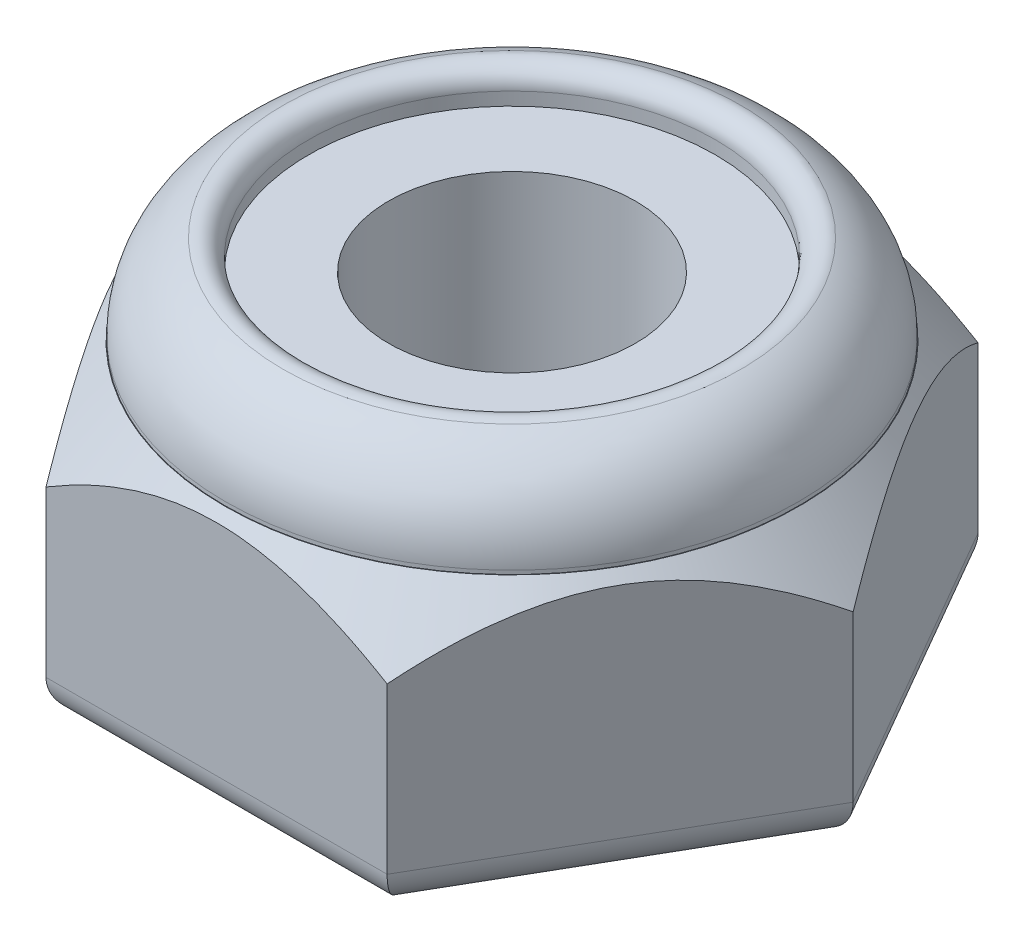
ISO-10303-21;
HEADER;
FILE_DESCRIPTION(('STEP AP214'),'2;1');
FILE_NAME('part.step','',(''),(''),'','','');
FILE_SCHEMA(('AUTOMOTIVE_DESIGN { 1 0 10303 214 1 1 1 1 }'));
ENDSEC;
DATA;
#1=APPLICATION_CONTEXT('core data for automotive mechanical design processes');
#2=APPLICATION_PROTOCOL_DEFINITION('international standard','automotive_design',2000,#1);
#3=PRODUCT_CONTEXT('',#1,'mechanical');
#4=PRODUCT('Part','Part','',(#3));
#5=PRODUCT_RELATED_PRODUCT_CATEGORY('part','',(#4));
#6=PRODUCT_DEFINITION_FORMATION('','',#4);
#7=PRODUCT_DEFINITION_CONTEXT('part definition',#1,'design');
#8=PRODUCT_DEFINITION('design','',#6,#7);
#9=PRODUCT_DEFINITION_SHAPE('','',#8);
#10=(LENGTH_UNIT() NAMED_UNIT(*) SI_UNIT(.MILLI.,.METRE.));
#11=(NAMED_UNIT(*) PLANE_ANGLE_UNIT() SI_UNIT($,.RADIAN.));
#12=(NAMED_UNIT(*) SI_UNIT($,.STERADIAN.) SOLID_ANGLE_UNIT());
#13=UNCERTAINTY_MEASURE_WITH_UNIT(LENGTH_MEASURE(1.E-05),#10,'distance_accuracy_value','');
#14=(GEOMETRIC_REPRESENTATION_CONTEXT(3) GLOBAL_UNCERTAINTY_ASSIGNED_CONTEXT((#13)) GLOBAL_UNIT_ASSIGNED_CONTEXT((#10,
#11,#12)) REPRESENTATION_CONTEXT('',''));
#15=CARTESIAN_POINT('',(0.,0.,0.));
#16=DIRECTION('',(0.,0.,1.));
#17=DIRECTION('',(1.,0.,0.));
#18=AXIS2_PLACEMENT_3D('',#15,#16,#17);
#19=CARTESIAN_POINT('',(0.,4.9784,0.));
#20=DIRECTION('',(0.,-1.,0.));
#21=DIRECTION('',(0.,0.,1.));
#22=AXIS2_PLACEMENT_3D('',#19,#20,#21);
#23=CYLINDRICAL_SURFACE('',#22,3.937);
#24=CARTESIAN_POINT('',(0.,3.7084,0.));
#25=DIRECTION('',(0.,-1.,0.));
#26=DIRECTION('',(0.,0.,-1.));
#27=AXIS2_PLACEMENT_3D('',#24,#25,#26);
#28=CIRCLE('',#27,3.937);
#29=CARTESIAN_POINT('',(0.,3.7084,-3.937));
#30=VERTEX_POINT('',#29);
#31=EDGE_CURVE('E170',#30,#30,#28,.T.);
#32=ORIENTED_EDGE('',*,*,#31,.T.);
#33=EDGE_LOOP('',(#32));
#34=FACE_BOUND('',#33,.T.);
#35=CARTESIAN_POINT('',(0.,3.6576,0.));
#36=DIRECTION('',(0.,1.,0.));
#37=DIRECTION('',(0.,0.,1.));
#38=AXIS2_PLACEMENT_3D('',#35,#36,#37);
#39=CIRCLE('',#38,3.937);
#40=CARTESIAN_POINT('',(0.,3.6576,3.937));
#41=VERTEX_POINT('',#40);
#42=EDGE_CURVE('E37',#41,#41,#39,.F.);
#43=ORIENTED_EDGE('',*,*,#42,.F.);
#44=EDGE_LOOP('',(#43));
#45=FACE_BOUND('',#44,.T.);
#46=ADVANCED_FACE('F34',(#34,#45),#23,.T.);
#47=CARTESIAN_POINT('',(0.,3.7084,0.));
#48=DIRECTION('',(0.,1.,0.));
#49=DIRECTION('',(0.,0.,-1.));
#50=AXIS2_PLACEMENT_3D('',#47,#48,#49);
#51=TOROIDAL_SURFACE('',#50,2.667,1.27);
#52=ORIENTED_EDGE('',*,*,#31,.F.);
#53=EDGE_LOOP('',(#52));
#54=FACE_BOUND('',#53,.T.);
#55=CARTESIAN_POINT('',(0.,4.88572150982644,0.));
#56=DIRECTION('',(0.,1.,0.));
#57=DIRECTION('',(0.,0.,1.));
#58=AXIS2_PLACEMENT_3D('',#55,#56,#57);
#59=CIRCLE('',#58,3.14325);
#60=CARTESIAN_POINT('',(0.,4.88572150982644,3.14325));
#61=VERTEX_POINT('',#60);
#62=EDGE_CURVE('E174',#61,#61,#59,.F.);
#63=ORIENTED_EDGE('',*,*,#62,.T.);
#64=EDGE_LOOP('',(#63));
#65=FACE_BOUND('',#64,.T.);
#66=ADVANCED_FACE('F160',(#54,#65),#51,.T.);
#67=CARTESIAN_POINT('',(2.34315,3.6576,-4.05845484975502));
#68=DIRECTION('',(0.,-1.,0.));
#69=DIRECTION('',(0.,0.,1.));
#70=AXIS2_PLACEMENT_3D('',#67,#68,#69);
#71=PLANE('',#70);
#72=ORIENTED_EDGE('',*,*,#42,.T.);
#73=EDGE_LOOP('',(#72));
#74=FACE_BOUND('',#73,.T.);
#75=CARTESIAN_POINT('',(0.,3.65760000011051,0.));
#76=DIRECTION('',(0.,1.,0.));
#77=DIRECTION('',(0.,0.,1.));
#78=AXIS2_PLACEMENT_3D('',#75,#76,#77);
#79=CIRCLE('',#78,3.94407100938664);
#80=CARTESIAN_POINT('',(0.,3.65760000011051,3.94407100938664));
#81=VERTEX_POINT('',#80);
#82=EDGE_CURVE('E130',#81,#81,#79,.T.);
#83=ORIENTED_EDGE('',*,*,#82,.T.);
#84=EDGE_LOOP('',(#83));
#85=FACE_BOUND('',#84,.T.);
#86=ADVANCED_FACE('F165',(#74,#85),#71,.F.);
#87=CARTESIAN_POINT('',(0.,4.65025720786115,0.));
#88=DIRECTION('',(0.,-1.,0.));
#89=DIRECTION('',(0.,0.,1.));
#90=AXIS2_PLACEMENT_3D('',#87,#88,#89);
#91=TOROIDAL_SURFACE('',#90,3.048,0.254);
#92=CARTESIAN_POINT('',(0.,4.65025720786115,0.));
#93=DIRECTION('',(0.,-1.,0.));
#94=DIRECTION('',(0.,0.,-1.));
#95=AXIS2_PLACEMENT_3D('',#92,#93,#94);
#96=CIRCLE('',#95,2.794);
#97=CARTESIAN_POINT('',(0.,4.65025720786115,-2.794));
#98=VERTEX_POINT('',#97);
#99=EDGE_CURVE('E127',#98,#98,#96,.F.);
#100=ORIENTED_EDGE('',*,*,#99,.F.);
#101=EDGE_LOOP('',(#100));
#102=FACE_BOUND('',#101,.T.);
#103=ORIENTED_EDGE('',*,*,#62,.F.);
#104=EDGE_LOOP('',(#103));
#105=FACE_BOUND('',#104,.T.);
#106=ADVANCED_FACE('F157',(#102,#105),#91,.T.);
#107=CARTESIAN_POINT('',(0.,2.76773860969115,0.));
#108=DIRECTION('',(0.,-1.,0.));
#109=DIRECTION('',(0.,0.,1.));
#110=AXIS2_PLACEMENT_3D('',#107,#108,#109);
#111=CONICAL_SURFACE('',#110,4.69075337389313,0.698131700802158);
#112=CARTESIAN_POINT('',(-4.68630000001476,2.77304593398821,5.3333815551093E-11));
#113=CARTESIAN_POINT('',(-4.65177717141793,2.81418235889091,-0.0597952931149053));
#114=CARTESIAN_POINT('',(-4.61695780288956,2.85432113110728,-0.120104208500933));
#115=CARTESIAN_POINT('',(-4.54666264441453,2.93230661020916,-0.241858994511412));
#116=CARTESIAN_POINT('',(-4.51118655194523,2.97015222462005,-0.303305389120424));
#117=CARTESIAN_POINT('',(-4.40329561885259,3.08018701500149,-0.490177966909938));
#118=CARTESIAN_POINT('',(-4.32983334004397,3.14837015576205,-0.617418366247689));
#119=CARTESIAN_POINT('',(-4.1797796499728,3.27092778609509,-0.877318981315214));
#120=CARTESIAN_POINT('',(-4.10317943932402,3.32525984886677,-1.00999443802899));
#121=CARTESIAN_POINT('',(-3.94747591651278,3.41577217646147,-1.27968085045525));
#122=CARTESIAN_POINT('',(-3.86837998243724,3.45200143013375,-1.4166790269463));
#123=CARTESIAN_POINT('',(-3.73746585196202,3.49372811243502,-1.64342895235813));
#124=CARTESIAN_POINT('',(-3.68614686019516,3.50560413715319,-1.73231605349153));
#125=CARTESIAN_POINT('',(-3.58316406708587,3.52008140702852,-1.91068748346216));
#126=CARTESIAN_POINT('',(-3.53150020834088,3.5226810675312,-2.00017191172355));
#127=CARTESIAN_POINT('',(-3.42855034551142,3.51847006524789,-2.17848630477643));
#128=CARTESIAN_POINT('',(-3.3772638088531,3.51171021118305,-2.26731719201287));
#129=CARTESIAN_POINT('',(-3.27519197708947,3.48921023555424,-2.4441107906491));
#130=CARTESIAN_POINT('',(-3.22440670715057,3.4734696654174,-2.53207345845939));
#131=CARTESIAN_POINT('',(-3.10963060134479,3.42817062222156,-2.73087150520989));
#132=CARTESIAN_POINT('',(-3.04589899577138,3.39598542076133,-2.84125788411098));
#133=CARTESIAN_POINT('',(-2.92018166739655,3.32004827846255,-3.05900668424801));
#134=CARTESIAN_POINT('',(-2.85819691962206,3.27629001415058,-3.16636741668776));
#135=CARTESIAN_POINT('',(-2.735889068299,3.17910361386979,-3.37821082934389));
#136=CARTESIAN_POINT('',(-2.67557364738244,3.12563730731956,-3.48268020285126));
#137=CARTESIAN_POINT('',(-2.55683004320588,3.01104764609313,-3.68835015835892));
#138=CARTESIAN_POINT('',(-2.49840123089761,2.94992687749399,-3.78955182990274));
#139=CARTESIAN_POINT('',(-2.42439626092569,2.86741854625153,-3.91773219790672));
#140=CARTESIAN_POINT('',(-2.40802320106583,2.84883596648691,-3.94609116945937));
#141=CARTESIAN_POINT('',(-2.3754621576302,2.81125673907332,-4.00248855103733));
#142=CARTESIAN_POINT('',(-2.35927376441604,2.79226151161516,-4.03052767057717));
#143=CARTESIAN_POINT('',(-2.3431499999717,2.77304593399368,-4.05845484980404));
#144=B_SPLINE_CURVE_WITH_KNOTS('',3,(#112,#113,#114,#115,#116,#117,#118,#119,#120,#121,#122,
#123,#124,#125,#126,#127,#128,#129,#130,#131,#132,#133,#134,#135,#136,#137,#138,#139,#140,#141,
#142,#143),.UNSPECIFIED.,.F.,.F.,(4,2,2,2,2,2,2,2,2,2,2,2,2,2,2,4),(0.,0.241096809088565,
0.48230758945251,0.967637153847365,1.45443592242802,1.93991010956963,2.24950193433618,
2.5591466432483,2.86711700071403,3.17510274216898,3.56882084711336,3.96275452403261,
4.35827201930639,4.75365624679115,4.86660838982693,4.97921936905084),.UNSPECIFIED.);
#145=CARTESIAN_POINT('',(-4.68630000002839,2.77304593399358,0.));
#146=VERTEX_POINT('',#145);
#147=CARTESIAN_POINT('',(-2.34315000001419,2.77304593399358,-4.05845484977959));
#148=VERTEX_POINT('',#147);
#149=EDGE_CURVE('E111',#146,#148,#144,.T.);
#150=ORIENTED_EDGE('',*,*,#149,.F.);
#151=CARTESIAN_POINT('',(-2.3431499999612,2.77304593398821,4.05845484979447));
#152=CARTESIAN_POINT('',(-2.37767282857321,2.81418235889091,3.99865955663499));
#153=CARTESIAN_POINT('',(-2.41249219710802,2.85432113110728,3.93835064125268));
#154=CARTESIAN_POINT('',(-2.48278735558791,2.93230661020916,3.81659585524501));
#155=CARTESIAN_POINT('',(-2.51826344805563,2.97015222462005,3.75514946063508));
#156=CARTESIAN_POINT('',(-2.62615438114571,3.08018701500149,3.56827688284409));
#157=CARTESIAN_POINT('',(-2.69961665995557,3.14837015576205,3.44103648350706));
#158=CARTESIAN_POINT('',(-2.84967035002766,3.27092778609509,3.18113586844007));
#159=CARTESIAN_POINT('',(-2.9262705606761,3.32525984886676,3.0484604117261));
#160=CARTESIAN_POINT('',(-3.08197408348711,3.41577217646147,2.7787739992997));
#161=CARTESIAN_POINT('',(-3.16107001756274,3.45200143013375,2.6417758228087));
#162=CARTESIAN_POINT('',(-3.291984148038,3.49372811243502,2.4150258973969));
#163=CARTESIAN_POINT('',(-3.34330313980485,3.50560413715318,2.32613879626349));
#164=CARTESIAN_POINT('',(-3.44628593291413,3.52008140702852,2.14776736629286));
#165=CARTESIAN_POINT('',(-3.49794979165912,3.5226810675312,2.05828293803147));
#166=CARTESIAN_POINT('',(-3.60089965448859,3.51847006524788,1.87996854497859));
#167=CARTESIAN_POINT('',(-3.6521861911469,3.51171021118305,1.79113765774214));
#168=CARTESIAN_POINT('',(-3.75425802291053,3.48921023555424,1.61434405910592));
#169=CARTESIAN_POINT('',(-3.80504329284944,3.4734696654174,1.52638139129563));
#170=CARTESIAN_POINT('',(-3.91981939865521,3.42817062222155,1.32758334454512));
#171=CARTESIAN_POINT('',(-3.98355100422863,3.39598542076132,1.21719696564403));
#172=CARTESIAN_POINT('',(-4.10926833260346,3.32004827846254,0.999448165507007));
#173=CARTESIAN_POINT('',(-4.17125308037794,3.27629001415057,0.892087433067258));
#174=CARTESIAN_POINT('',(-4.29356093170101,3.17910361386978,0.680244020411132));
#175=CARTESIAN_POINT('',(-4.35387635261756,3.12563730731955,0.575774646903757));
#176=CARTESIAN_POINT('',(-4.47261995679413,3.01104764609312,0.370104691396094));
#177=CARTESIAN_POINT('',(-4.53104876910239,2.94992687749399,0.268903019852276));
#178=CARTESIAN_POINT('',(-4.60505373907432,2.86741854625152,0.140722651848295));
#179=CARTESIAN_POINT('',(-4.62142679893418,2.84883596648691,0.112363680295645));
#180=CARTESIAN_POINT('',(-4.6539878423698,2.81125673907331,0.0559662987176857));
#181=CARTESIAN_POINT('',(-4.67017623558397,2.79226151161515,0.0279271791778497));
#182=CARTESIAN_POINT('',(-4.68630000002831,2.77304593399367,-4.90190782069009E-11));
#183=B_SPLINE_CURVE_WITH_KNOTS('',3,(#151,#152,#153,#154,#155,#156,#157,#158,#159,#160,#161,
#162,#163,#164,#165,#166,#167,#168,#169,#170,#171,#172,#173,#174,#175,#176,#177,#178,#179,#180,
#181,#182),.UNSPECIFIED.,.F.,.F.,(4,2,2,2,2,2,2,2,2,2,2,2,2,2,2,4),(0.,0.241096809088564,
0.482307589452509,0.967637153847362,1.45443592242802,1.93991010956962,2.24950193433617,
2.5591466432483,2.86711700071402,3.17510274216897,3.56882084711335,3.9627545240326,
4.35827201930639,4.75365624679114,4.86660838982692,4.97921936905084),.UNSPECIFIED.);
#184=CARTESIAN_POINT('',(-2.34315000001419,2.77304593399358,4.0584548497796));
#185=VERTEX_POINT('',#184);
#186=EDGE_CURVE('E239',#185,#146,#183,.T.);
#187=ORIENTED_EDGE('',*,*,#186,.F.);
#188=CARTESIAN_POINT('',(2.34315000005357,2.77304593398821,4.05845484974114));
#189=CARTESIAN_POINT('',(2.27415972170409,2.81414935271335,4.05845484974989));
#190=CARTESIAN_POINT('',(2.20457738522045,2.85425669884704,4.05845484975361));
#191=CARTESIAN_POINT('',(2.06410193528096,2.93218331968193,4.05845484975643));
#192=CARTESIAN_POINT('',(1.99320821641151,2.97000150131419,4.05845484975552));
#193=CARTESIAN_POINT('',(1.77754688772429,3.07999086386454,4.05845484975402));
#194=CARTESIAN_POINT('',(1.63068545869954,3.1481589403704,4.0584548497547));
#195=CARTESIAN_POINT('',(1.33052752457963,3.27077676919261,4.05845484975534));
#196=CARTESIAN_POINT('',(1.17720631609342,3.32516696804195,4.0584548497553));
#197=CARTESIAN_POINT('',(0.865613503807778,3.41574608766058,4.05845484975474));
#198=CARTESIAN_POINT('',(0.707359229311901,3.45199244874898,4.0584548497542));
#199=CARTESIAN_POINT('',(0.456822143345069,3.49192146546895,4.05845484975548));
#200=CARTESIAN_POINT('',(0.365672921156201,3.50290887295604,4.05845484975637));
#201=CARTESIAN_POINT('',(0.183016322004481,3.51758027913677,4.05845484975367));
#202=CARTESIAN_POINT('',(0.0915105175250814,3.5212834103706,4.05845484975008));
#203=CARTESIAN_POINT('',(-0.104649468641441,3.52128177491764,4.0584548497495));
#204=CARTESIAN_POINT('',(-0.209305100872023,3.51643705333648,4.05845484975354));
#205=CARTESIAN_POINT('',(-0.41778718190987,3.49730239560234,4.0584548497565));
#206=CARTESIAN_POINT('',(-0.521613181352877,3.48300765111693,4.05845484975542));
#207=CARTESIAN_POINT('',(-0.728332544913562,3.44553375886281,4.05845484975462));
#208=CARTESIAN_POINT('',(-0.831215331558566,3.42229697724237,4.05845484975491));
#209=CARTESIAN_POINT('',(-1.03487580391125,3.36791830054732,4.05845484975513));
#210=CARTESIAN_POINT('',(-1.13565289468809,3.33677420321767,4.05845484975505));
#211=CARTESIAN_POINT('',(-1.33273383822163,3.26838741918098,4.05845484975499));
#212=CARTESIAN_POINT('',(-1.42908716226035,3.23128582684655,4.05845484975501));
#213=CARTESIAN_POINT('',(-1.61947291708309,3.15151071591982,4.05845484975503));
#214=CARTESIAN_POINT('',(-1.71350470709807,3.10883567899406,4.05845484975502));
#215=CARTESIAN_POINT('',(-1.89803195382395,3.01941532331662,4.05845484975502));
#216=CARTESIAN_POINT('',(-1.98855798046431,2.97273255726059,4.05845484975502));
#217=CARTESIAN_POINT('',(-2.16742834958162,2.87556944084479,4.05845484975502));
#218=CARTESIAN_POINT('',(-2.25577492892455,2.82509321932284,4.05845484975502));
#219=CARTESIAN_POINT('',(-2.34315000005566,2.77304593399424,4.05845484975502));
#220=B_SPLINE_CURVE_WITH_KNOTS('',3,(#188,#189,#190,#191,#192,#193,#194,#195,#196,#197,#198,
#199,#200,#201,#202,#203,#204,#205,#206,#207,#208,#209,#210,#211,#212,#213,#214,#215,#216,#217,
#218,#219),.UNSPECIFIED.,.F.,.F.,(4,2,2,2,2,2,2,2,2,2,2,2,2,2,2,4),(0.,0.24090330355952,
0.481920744736243,0.96705946696845,1.4542606837498,1.93990959177135,2.21507934695766,
2.48952538389391,2.80337599596432,3.11738642360394,3.43345557972405,3.74961286055439,
4.0591611810716,4.36879400620232,4.67425708545866,4.97939238068026),.UNSPECIFIED.);
#221=CARTESIAN_POINT('',(2.34315000001419,2.77304593399358,4.0584548497796));
#222=VERTEX_POINT('',#221);
#223=EDGE_CURVE('E214',#222,#185,#220,.T.);
#224=ORIENTED_EDGE('',*,*,#223,.F.);
#225=CARTESIAN_POINT('',(4.68630000001476,2.77304593398822,-5.33267015141622E-11));
#226=CARTESIAN_POINT('',(4.65177717141792,2.81418235889091,0.0597952931149122));
#227=CARTESIAN_POINT('',(4.61695780288956,2.85432113110729,0.12010420850094));
#228=CARTESIAN_POINT('',(4.54666264441452,2.93230661020917,0.241858994511418));
#229=CARTESIAN_POINT('',(4.51118655194522,2.97015222462005,0.303305389120429));
#230=CARTESIAN_POINT('',(4.40329561885258,3.0801870150015,0.490177966909942));
#231=CARTESIAN_POINT('',(4.32983334004397,3.14837015576206,0.617418366247694));
#232=CARTESIAN_POINT('',(4.1797796499728,3.27092778609509,0.877318981315217));
#233=CARTESIAN_POINT('',(4.10317943932402,3.32525984886677,1.00999443802899));
#234=CARTESIAN_POINT('',(3.94747591651277,3.41577217646148,1.27968085045525));
#235=CARTESIAN_POINT('',(3.86837998243724,3.45200143013375,1.4166790269463));
#236=CARTESIAN_POINT('',(3.73746585196202,3.49372811243502,1.64342895235813));
#237=CARTESIAN_POINT('',(3.68614686019516,3.50560413715319,1.73231605349153));
#238=CARTESIAN_POINT('',(3.58316406708587,3.52008140702852,1.91068748346216));
#239=CARTESIAN_POINT('',(3.53150020834088,3.5226810675312,2.00017191172355));
#240=CARTESIAN_POINT('',(3.42855034551142,3.51847006524789,2.17848630477643));
#241=CARTESIAN_POINT('',(3.3772638088531,3.51171021118306,2.26731719201287));
#242=CARTESIAN_POINT('',(3.27519197708948,3.48921023555424,2.4441107906491));
#243=CARTESIAN_POINT('',(3.22440670715057,3.4734696654174,2.53207345845939));
#244=CARTESIAN_POINT('',(3.10963060134479,3.42817062222156,2.73087150520989));
#245=CARTESIAN_POINT('',(3.04589899577138,3.39598542076133,2.84125788411098));
#246=CARTESIAN_POINT('',(2.92018166739655,3.32004827846255,3.05900668424801));
#247=CARTESIAN_POINT('',(2.85819691962206,3.27629001415058,3.16636741668776));
#248=CARTESIAN_POINT('',(2.735889068299,3.17910361386979,3.37821082934388));
#249=CARTESIAN_POINT('',(2.67557364738245,3.12563730731956,3.48268020285126));
#250=CARTESIAN_POINT('',(2.55683004320588,3.01104764609313,3.68835015835892));
#251=CARTESIAN_POINT('',(2.49840123089762,2.94992687749399,3.78955182990274));
#252=CARTESIAN_POINT('',(2.42439626092569,2.86741854625153,3.91773219790672));
#253=CARTESIAN_POINT('',(2.40802320106583,2.84883596648691,3.94609116945937));
#254=CARTESIAN_POINT('',(2.3754621576302,2.81125673907332,4.00248855103733));
#255=CARTESIAN_POINT('',(2.35927376441604,2.79226151161516,4.03052767057717));
#256=CARTESIAN_POINT('',(2.3431499999717,2.77304593399368,4.05845484980404));
#257=B_SPLINE_CURVE_WITH_KNOTS('',3,(#225,#226,#227,#228,#229,#230,#231,#232,#233,#234,#235,
#236,#237,#238,#239,#240,#241,#242,#243,#244,#245,#246,#247,#248,#249,#250,#251,#252,#253,#254,
#255,#256),.UNSPECIFIED.,.F.,.F.,(4,2,2,2,2,2,2,2,2,2,2,2,2,2,2,4),(0.,0.241096809088564,
0.482307589452508,0.96763715384736,1.45443592242801,1.93991010956962,2.24950193433616,
2.55914664324829,2.86711700071401,3.17510274216896,3.56882084711335,3.96275452403259,
4.35827201930638,4.75365624679113,4.86660838982692,4.97921936905084),.UNSPECIFIED.);
#258=CARTESIAN_POINT('',(4.68630000001419,2.7730459340105,2.45821360759307E-11));
#259=VERTEX_POINT('',#258);
#260=EDGE_CURVE('E126',#259,#222,#257,.T.);
#261=ORIENTED_EDGE('',*,*,#260,.F.);
#262=CARTESIAN_POINT('',(2.3431499999612,2.77304593398822,-4.05845484979446));
#263=CARTESIAN_POINT('',(2.37767282857321,2.81418235889091,-3.99865955663499));
#264=CARTESIAN_POINT('',(2.41249219710801,2.85432113110729,-3.93835064125267));
#265=CARTESIAN_POINT('',(2.48278735558791,2.93230661020917,-3.816595855245));
#266=CARTESIAN_POINT('',(2.51826344805563,2.97015222462005,-3.75514946063508));
#267=CARTESIAN_POINT('',(2.62615438114571,3.08018701500149,-3.56827688284408));
#268=CARTESIAN_POINT('',(2.69961665995557,3.14837015576206,-3.44103648350706));
#269=CARTESIAN_POINT('',(2.84967035002766,3.2709277860951,-3.18113586844006));
#270=CARTESIAN_POINT('',(2.9262705606761,3.32525984886677,-3.04846041172609));
#271=CARTESIAN_POINT('',(3.08197408348711,3.41577217646148,-2.77877399929969));
#272=CARTESIAN_POINT('',(3.16107001756274,3.45200143013376,-2.64177582280869));
#273=CARTESIAN_POINT('',(3.291984148038,3.49372811243503,-2.41502589739689));
#274=CARTESIAN_POINT('',(3.34330313980485,3.50560413715319,-2.32613879626348));
#275=CARTESIAN_POINT('',(3.44628593291413,3.52008140702853,-2.14776736629285));
#276=CARTESIAN_POINT('',(3.49794979165912,3.52268106753121,-2.05828293803146));
#277=CARTESIAN_POINT('',(3.60089965448859,3.51847006524789,-1.87996854497858));
#278=CARTESIAN_POINT('',(3.6521861911469,3.51171021118306,-1.79113765774214));
#279=CARTESIAN_POINT('',(3.75425802291053,3.48921023555425,-1.61434405910591));
#280=CARTESIAN_POINT('',(3.80504329284943,3.47346966541741,-1.52638139129562));
#281=CARTESIAN_POINT('',(3.91981939865521,3.42817062222156,-1.32758334454512));
#282=CARTESIAN_POINT('',(3.98355100422862,3.39598542076133,-1.21719696564403));
#283=CARTESIAN_POINT('',(4.10926833260345,3.32004827846255,-0.999448165506999));
#284=CARTESIAN_POINT('',(4.17125308037794,3.27629001415058,-0.892087433067251));
#285=CARTESIAN_POINT('',(4.293560931701,3.17910361386979,-0.680244020411125));
#286=CARTESIAN_POINT('',(4.35387635261756,3.12563730731956,-0.575774646903749));
#287=CARTESIAN_POINT('',(4.47261995679412,3.01104764609313,-0.370104691396086));
#288=CARTESIAN_POINT('',(4.53104876910239,2.94992687749399,-0.268903019852268));
#289=CARTESIAN_POINT('',(4.60505373907431,2.86741854625153,-0.140722651848287));
#290=CARTESIAN_POINT('',(4.62142679893417,2.84883596648691,-0.112363680295636));
#291=CARTESIAN_POINT('',(4.6539878423698,2.81125673907332,-0.055966298717677));
#292=CARTESIAN_POINT('',(4.67017623558396,2.79226151161516,-0.0279271791778412));
#293=CARTESIAN_POINT('',(4.6863000000283,2.77304593399368,4.90273860582746E-11));
#294=B_SPLINE_CURVE_WITH_KNOTS('',3,(#262,#263,#264,#265,#266,#267,#268,#269,#270,#271,#272,
#273,#274,#275,#276,#277,#278,#279,#280,#281,#282,#283,#284,#285,#286,#287,#288,#289,#290,#291,
#292,#293),.UNSPECIFIED.,.F.,.F.,(4,2,2,2,2,2,2,2,2,2,2,2,2,2,2,4),(0.,0.241096809088565,
0.48230758945251,0.967637153847363,1.45443592242802,1.93991010956962,2.24950193433617,
2.5591466432483,2.86711700071402,3.17510274216897,3.56882084711335,3.9627545240326,
4.35827201930639,4.75365624679114,4.86660838982692,4.97921936905084),.UNSPECIFIED.);
#295=CARTESIAN_POINT('',(2.34315000001419,2.77304593399358,-4.05845484977959));
#296=VERTEX_POINT('',#295);
#297=EDGE_CURVE('E105',#296,#259,#294,.T.);
#298=ORIENTED_EDGE('',*,*,#297,.F.);
#299=CARTESIAN_POINT('',(-2.34315000005357,2.77304593398822,-4.05845484974113));
#300=CARTESIAN_POINT('',(-2.27415972170409,2.81414935271336,-4.05845484974989));
#301=CARTESIAN_POINT('',(-2.20457738522044,2.85425669884705,-4.05845484975361));
#302=CARTESIAN_POINT('',(-2.06410193528096,2.93218331968193,-4.05845484975642));
#303=CARTESIAN_POINT('',(-1.99320821641151,2.9700015013142,-4.05845484975551));
#304=CARTESIAN_POINT('',(-1.77754688772429,3.07999086386455,-4.05845484975401));
#305=CARTESIAN_POINT('',(-1.63068545869954,3.1481589403704,-4.05845484975469));
#306=CARTESIAN_POINT('',(-1.33052752457963,3.27077676919262,-4.05845484975534));
#307=CARTESIAN_POINT('',(-1.17720631609342,3.32516696804196,-4.0584548497553));
#308=CARTESIAN_POINT('',(-0.865613503807779,3.41574608766059,-4.05845484975473));
#309=CARTESIAN_POINT('',(-0.707359229311903,3.45199244874899,-4.0584548497542));
#310=CARTESIAN_POINT('',(-0.456822143345071,3.49192146546895,-4.05845484975548));
#311=CARTESIAN_POINT('',(-0.365672921156202,3.50290887295604,-4.05845484975637));
#312=CARTESIAN_POINT('',(-0.183016322004482,3.51758027913678,-4.05845484975366));
#313=CARTESIAN_POINT('',(-0.0915105175250817,3.52128341037061,-4.05845484975007));
#314=CARTESIAN_POINT('',(0.104649468641441,3.52128177491765,-4.0584548497495));
#315=CARTESIAN_POINT('',(0.209305100872023,3.51643705333648,-4.05845484975354));
#316=CARTESIAN_POINT('',(0.417787181909869,3.49730239560235,-4.05845484975649));
#317=CARTESIAN_POINT('',(0.521613181352877,3.48300765111694,-4.05845484975541));
#318=CARTESIAN_POINT('',(0.728332544913562,3.44553375886282,-4.05845484975462));
#319=CARTESIAN_POINT('',(0.831215331558566,3.42229697724238,-4.05845484975491));
#320=CARTESIAN_POINT('',(1.03487580391125,3.36791830054733,-4.05845484975512));
#321=CARTESIAN_POINT('',(1.13565289468809,3.33677420321768,-4.05845484975504));
#322=CARTESIAN_POINT('',(1.33273383822163,3.26838741918099,-4.05845484975499));
#323=CARTESIAN_POINT('',(1.42908716226035,3.23128582684656,-4.05845484975501));
#324=CARTESIAN_POINT('',(1.61947291708309,3.15151071591982,-4.05845484975502));
#325=CARTESIAN_POINT('',(1.71350470709807,3.10883567899407,-4.05845484975502));
#326=CARTESIAN_POINT('',(1.89803195382395,3.01941532331662,-4.05845484975501));
#327=CARTESIAN_POINT('',(1.98855798046432,2.97273255726059,-4.05845484975502));
#328=CARTESIAN_POINT('',(2.16742834958163,2.87556944084479,-4.05845484975502));
#329=CARTESIAN_POINT('',(2.25577492892455,2.82509321932285,-4.05845484975502));
#330=CARTESIAN_POINT('',(2.34315000005566,2.77304593399424,-4.05845484975502));
#331=B_SPLINE_CURVE_WITH_KNOTS('',3,(#299,#300,#301,#302,#303,#304,#305,#306,#307,#308,#309,
#310,#311,#312,#313,#314,#315,#316,#317,#318,#319,#320,#321,#322,#323,#324,#325,#326,#327,#328,
#329,#330),.UNSPECIFIED.,.F.,.F.,(4,2,2,2,2,2,2,2,2,2,2,2,2,2,2,4),(0.,0.24090330355952,
0.481920744736242,0.967059466968448,1.4542606837498,1.93990959177135,2.21507934695766,
2.4895253838939,2.80337599596431,3.11738642360394,3.43345557972405,3.74961286055439,
4.0591611810716,4.36879400620232,4.67425708545867,4.97939238068026),.UNSPECIFIED.);
#332=EDGE_CURVE('E112',#148,#296,#331,.T.);
#333=ORIENTED_EDGE('',*,*,#332,.F.);
#334=EDGE_LOOP('',(#150,#187,#224,#261,#298,#333));
#335=FACE_BOUND('',#334,.T.);
#336=ORIENTED_EDGE('',*,*,#82,.F.);
#337=EDGE_LOOP('',(#336));
#338=FACE_BOUND('',#337,.T.);
#339=ADVANCED_FACE('F122',(#335,#338),#111,.T.);
#340=CARTESIAN_POINT('',(0.,4.4704,0.));
#341=DIRECTION('',(0.,1.,0.));
#342=DIRECTION('',(0.,0.,-1.));
#343=AXIS2_PLACEMENT_3D('',#340,#341,#342);
#344=CYLINDRICAL_SURFACE('',#343,2.794);
#345=ORIENTED_EDGE('',*,*,#99,.T.);
#346=EDGE_LOOP('',(#345));
#347=FACE_BOUND('',#346,.T.);
#348=CARTESIAN_POINT('',(0.,4.4704,0.));
#349=DIRECTION('',(0.,-1.,0.));
#350=DIRECTION('',(0.,0.,-1.));
#351=AXIS2_PLACEMENT_3D('',#348,#349,#350);
#352=CIRCLE('',#351,2.794);
#353=CARTESIAN_POINT('',(0.,4.4704,-2.794));
#354=VERTEX_POINT('',#353);
#355=EDGE_CURVE('E202',#354,#354,#352,.T.);
#356=ORIENTED_EDGE('',*,*,#355,.T.);
#357=EDGE_LOOP('',(#356));
#358=FACE_BOUND('',#357,.T.);
#359=ADVANCED_FACE('F149',(#347,#358),#344,.F.);
#360=CARTESIAN_POINT('',(2.34315,3.6576,-4.05845484975502));
#361=DIRECTION('',(-0.866025403784439,0.,0.499999999999999));
#362=DIRECTION('',(-0.499999999999999,0.,-0.866025403784439));
#363=AXIS2_PLACEMENT_3D('',#360,#361,#362);
#364=PLANE('',#363);
#365=DIRECTION('',(-0.499999999999999,0.,-0.866025403784439));
#366=VECTOR('',#365,1.);
#367=CARTESIAN_POINT('',(2.34315,0.508,-4.05845484975502));
#368=LINE('',#367,#366);
#369=CARTESIAN_POINT('',(4.6863,0.508,0.));
#370=VERTEX_POINT('',#369);
#371=CARTESIAN_POINT('',(2.34315000000001,0.508,-4.05845484975502));
#372=VERTEX_POINT('',#371);
#373=EDGE_CURVE('E108',#370,#372,#368,.T.);
#374=ORIENTED_EDGE('',*,*,#373,.T.);
#375=DIRECTION('',(0.,1.,0.));
#376=VECTOR('',#375,1.);
#377=CARTESIAN_POINT('',(2.34315000000001,3.6576,-4.05845484975502));
#378=LINE('',#377,#376);
#379=EDGE_CURVE('E100',#296,#372,#378,.F.);
#380=ORIENTED_EDGE('',*,*,#379,.F.);
#381=ORIENTED_EDGE('',*,*,#297,.T.);
#382=DIRECTION('',(0.,1.,0.));
#383=VECTOR('',#382,1.);
#384=CARTESIAN_POINT('',(4.6863,3.6576,0.));
#385=LINE('',#384,#383);
#386=EDGE_CURVE('E205',#370,#259,#385,.T.);
#387=ORIENTED_EDGE('',*,*,#386,.F.);
#388=EDGE_LOOP('',(#374,#380,#381,#387));
#389=FACE_BOUND('',#388,.T.);
#390=ADVANCED_FACE('F102',(#389),#364,.F.);
#391=CARTESIAN_POINT('',(-2.34315,3.6576,-4.05845484975501));
#392=DIRECTION('',(0.,0.,1.));
#393=DIRECTION('',(-1.,0.,0.));
#394=AXIS2_PLACEMENT_3D('',#391,#392,#393);
#395=PLANE('',#394);
#396=DIRECTION('',(-1.,0.,0.));
#397=VECTOR('',#396,1.);
#398=CARTESIAN_POINT('',(-2.34315,0.508,-4.05845484975501));
#399=LINE('',#398,#397);
#400=CARTESIAN_POINT('',(-2.34315,0.508,-4.05845484975501));
#401=VERTEX_POINT('',#400);
#402=EDGE_CURVE('E199',#372,#401,#399,.T.);
#403=ORIENTED_EDGE('',*,*,#402,.T.);
#404=DIRECTION('',(0.,1.,0.));
#405=VECTOR('',#404,1.);
#406=CARTESIAN_POINT('',(-2.34315,3.6576,-4.05845484975501));
#407=LINE('',#406,#405);
#408=EDGE_CURVE('E117',#148,#401,#407,.F.);
#409=ORIENTED_EDGE('',*,*,#408,.F.);
#410=ORIENTED_EDGE('',*,*,#332,.T.);
#411=ORIENTED_EDGE('',*,*,#379,.T.);
#412=EDGE_LOOP('',(#403,#409,#410,#411));
#413=FACE_BOUND('',#412,.T.);
#414=ADVANCED_FACE('F115',(#413),#395,.F.);
#415=CARTESIAN_POINT('',(-4.6863,3.6576,0.));
#416=DIRECTION('',(0.866025403784439,0.,0.5));
#417=DIRECTION('',(-0.5,0.,0.866025403784439));
#418=AXIS2_PLACEMENT_3D('',#415,#416,#417);
#419=PLANE('',#418);
#420=DIRECTION('',(-0.5,0.,0.866025403784439));
#421=VECTOR('',#420,1.);
#422=CARTESIAN_POINT('',(-4.6863,0.508,0.));
#423=LINE('',#422,#421);
#424=CARTESIAN_POINT('',(-4.6863,0.508,0.));
#425=VERTEX_POINT('',#424);
#426=EDGE_CURVE('E196',#401,#425,#423,.T.);
#427=ORIENTED_EDGE('',*,*,#426,.T.);
#428=DIRECTION('',(0.,1.,0.));
#429=VECTOR('',#428,1.);
#430=CARTESIAN_POINT('',(-4.6863,3.6576,0.));
#431=LINE('',#430,#429);
#432=EDGE_CURVE('E245',#146,#425,#431,.F.);
#433=ORIENTED_EDGE('',*,*,#432,.F.);
#434=ORIENTED_EDGE('',*,*,#149,.T.);
#435=ORIENTED_EDGE('',*,*,#408,.T.);
#436=EDGE_LOOP('',(#427,#433,#434,#435));
#437=FACE_BOUND('',#436,.T.);
#438=ADVANCED_FACE('F236',(#437),#419,.F.);
#439=CARTESIAN_POINT('',(-2.34315,3.6576,4.05845484975502));
#440=DIRECTION('',(0.866025403784438,0.,-0.5));
#441=DIRECTION('',(0.5,0.,0.866025403784438));
#442=AXIS2_PLACEMENT_3D('',#439,#440,#441);
#443=PLANE('',#442);
#444=DIRECTION('',(0.5,0.,0.866025403784438));
#445=VECTOR('',#444,1.);
#446=CARTESIAN_POINT('',(-2.34315,0.508,4.05845484975502));
#447=LINE('',#446,#445);
#448=CARTESIAN_POINT('',(-2.34315,0.508,4.05845484975502));
#449=VERTEX_POINT('',#448);
#450=EDGE_CURVE('E193',#425,#449,#447,.T.);
#451=ORIENTED_EDGE('',*,*,#450,.T.);
#452=DIRECTION('',(0.,1.,0.));
#453=VECTOR('',#452,1.);
#454=CARTESIAN_POINT('',(-2.34315,3.6576,4.05845484975502));
#455=LINE('',#454,#453);
#456=EDGE_CURVE('E213',#185,#449,#455,.F.);
#457=ORIENTED_EDGE('',*,*,#456,.F.);
#458=ORIENTED_EDGE('',*,*,#186,.T.);
#459=ORIENTED_EDGE('',*,*,#432,.T.);
#460=EDGE_LOOP('',(#451,#457,#458,#459));
#461=FACE_BOUND('',#460,.T.);
#462=ADVANCED_FACE('F232',(#461),#443,.F.);
#463=CARTESIAN_POINT('',(2.34315,3.6576,4.05845484975502));
#464=DIRECTION('',(0.,0.,-1.));
#465=DIRECTION('',(1.,0.,0.));
#466=AXIS2_PLACEMENT_3D('',#463,#464,#465);
#467=PLANE('',#466);
#468=DIRECTION('',(1.,0.,0.));
#469=VECTOR('',#468,1.);
#470=CARTESIAN_POINT('',(2.34315,0.508,4.05845484975502));
#471=LINE('',#470,#469);
#472=CARTESIAN_POINT('',(2.34315,0.508,4.05845484975502));
#473=VERTEX_POINT('',#472);
#474=EDGE_CURVE('E190',#449,#473,#471,.T.);
#475=ORIENTED_EDGE('',*,*,#474,.T.);
#476=DIRECTION('',(0.,1.,0.));
#477=VECTOR('',#476,1.);
#478=CARTESIAN_POINT('',(2.34315,3.6576,4.05845484975501));
#479=LINE('',#478,#477);
#480=EDGE_CURVE('E212',#222,#473,#479,.F.);
#481=ORIENTED_EDGE('',*,*,#480,.F.);
#482=ORIENTED_EDGE('',*,*,#223,.T.);
#483=ORIENTED_EDGE('',*,*,#456,.T.);
#484=EDGE_LOOP('',(#475,#481,#482,#483));
#485=FACE_BOUND('',#484,.T.);
#486=ADVANCED_FACE('F226',(#485),#467,.F.);
#487=CARTESIAN_POINT('',(4.6863,3.6576,0.));
#488=DIRECTION('',(-0.866025403784439,0.,-0.5));
#489=DIRECTION('',(0.5,0.,-0.866025403784439));
#490=AXIS2_PLACEMENT_3D('',#487,#488,#489);
#491=PLANE('',#490);
#492=DIRECTION('',(0.5,0.,-0.866025403784439));
#493=VECTOR('',#492,1.);
#494=CARTESIAN_POINT('',(4.6863,0.508,0.));
#495=LINE('',#494,#493);
#496=EDGE_CURVE('E187',#473,#370,#495,.T.);
#497=ORIENTED_EDGE('',*,*,#496,.T.);
#498=ORIENTED_EDGE('',*,*,#386,.T.);
#499=ORIENTED_EDGE('',*,*,#260,.T.);
#500=ORIENTED_EDGE('',*,*,#480,.T.);
#501=EDGE_LOOP('',(#497,#498,#499,#500));
#502=FACE_BOUND('',#501,.T.);
#503=ADVANCED_FACE('F221',(#502),#491,.F.);
#504=CARTESIAN_POINT('',(0.,4.4704,0.));
#505=DIRECTION('',(0.,1.,0.));
#506=DIRECTION('',(0.,0.,-1.));
#507=AXIS2_PLACEMENT_3D('',#504,#505,#506);
#508=PLANE('',#507);
#509=CARTESIAN_POINT('',(0.,4.4704,0.));
#510=DIRECTION('',(0.,-1.,0.));
#511=DIRECTION('',(0.,0.,-1.));
#512=AXIS2_PLACEMENT_3D('',#509,#510,#511);
#513=CIRCLE('',#512,1.69545);
#514=CARTESIAN_POINT('',(0.,4.4704,-1.69545));
#515=VERTEX_POINT('',#514);
#516=EDGE_CURVE('E180',#515,#515,#513,.F.);
#517=ORIENTED_EDGE('',*,*,#516,.F.);
#518=EDGE_LOOP('',(#517));
#519=FACE_BOUND('',#518,.T.);
#520=ORIENTED_EDGE('',*,*,#355,.F.);
#521=EDGE_LOOP('',(#520));
#522=FACE_BOUND('',#521,.T.);
#523=ADVANCED_FACE('F225',(#519,#522),#508,.T.);
#524=CARTESIAN_POINT('',(1.9032090948775,0.508,-3.80445484975502));
#525=DIRECTION('',(-0.499999999999999,0.,-0.866025403784439));
#526=DIRECTION('',(0.866025403784439,0.,-0.499999999999999));
#527=AXIS2_PLACEMENT_3D('',#524,#525,#526);
#528=CYLINDRICAL_SURFACE('',#527,0.508);
#529=CARTESIAN_POINT('',(2.04985606325167,0.508,-3.55045484975502));
#530=DIRECTION('',(0.866025403784439,0.,0.5));
#531=DIRECTION('',(-0.5,0.,0.866025403784439));
#532=AXIS2_PLACEMENT_3D('',#529,#530,#531);
#533=ELLIPSE('',#532,0.58658787349666,0.508);
#534=CARTESIAN_POINT('',(2.04985606325167,0.,-3.55045484975502));
#535=VERTEX_POINT('',#534);
#536=EDGE_CURVE('E200',#535,#372,#533,.T.);
#537=ORIENTED_EDGE('',*,*,#536,.T.);
#538=ORIENTED_EDGE('',*,*,#373,.F.);
#539=CARTESIAN_POINT('',(4.09971212650334,0.508,0.));
#540=DIRECTION('',(0.,0.,1.));
#541=DIRECTION('',(1.,0.,0.));
#542=AXIS2_PLACEMENT_3D('',#539,#540,#541);
#543=ELLIPSE('',#542,0.58658787349666,0.508);
#544=CARTESIAN_POINT('',(4.09971212650334,0.,0.));
#545=VERTEX_POINT('',#544);
#546=EDGE_CURVE('E184',#370,#545,#543,.F.);
#547=ORIENTED_EDGE('',*,*,#546,.T.);
#548=DIRECTION('',(-0.499999999999999,0.,-0.866025403784439));
#549=VECTOR('',#548,1.);
#550=CARTESIAN_POINT('',(4.09971212650334,0.,0.));
#551=LINE('',#550,#549);
#552=EDGE_CURVE('E183',#545,#535,#551,.T.);
#553=ORIENTED_EDGE('',*,*,#552,.T.);
#554=EDGE_LOOP('',(#537,#538,#547,#553));
#555=FACE_BOUND('',#554,.T.);
#556=ADVANCED_FACE('F331',(#555),#528,.T.);
#557=CARTESIAN_POINT('',(-2.34315,0.508,-3.55045484975501));
#558=DIRECTION('',(-1.,0.,0.));
#559=DIRECTION('',(0.,0.,-1.));
#560=AXIS2_PLACEMENT_3D('',#557,#558,#559);
#561=CYLINDRICAL_SURFACE('',#560,0.508);
#562=ORIENTED_EDGE('',*,*,#536,.F.);
#563=DIRECTION('',(1.,0.,0.));
#564=VECTOR('',#563,1.);
#565=CARTESIAN_POINT('',(2.34315,0.,-3.55045484975502));
#566=LINE('',#565,#564);
#567=CARTESIAN_POINT('',(-2.04985606325167,0.,-3.55045484975502));
#568=VERTEX_POINT('',#567);
#569=EDGE_CURVE('E427',#535,#568,#566,.F.);
#570=ORIENTED_EDGE('',*,*,#569,.T.);
#571=CARTESIAN_POINT('',(-2.04985606325167,0.508,-3.55045484975501));
#572=DIRECTION('',(0.866025403784439,0.,-0.5));
#573=DIRECTION('',(0.5,0.,0.866025403784439));
#574=AXIS2_PLACEMENT_3D('',#571,#572,#573);
#575=ELLIPSE('',#574,0.58658787349666,0.508);
#576=EDGE_CURVE('E197',#568,#401,#575,.T.);
#577=ORIENTED_EDGE('',*,*,#576,.T.);
#578=ORIENTED_EDGE('',*,*,#402,.F.);
#579=EDGE_LOOP('',(#562,#570,#577,#578));
#580=FACE_BOUND('',#579,.T.);
#581=ADVANCED_FACE('F340',(#580),#561,.T.);
#582=CARTESIAN_POINT('',(-4.24635909487751,0.508,0.254000000000004));
#583=DIRECTION('',(-0.5,0.,0.866025403784439));
#584=DIRECTION('',(-0.866025403784439,0.,-0.5));
#585=AXIS2_PLACEMENT_3D('',#582,#583,#584);
#586=CYLINDRICAL_SURFACE('',#585,0.508);
#587=ORIENTED_EDGE('',*,*,#576,.F.);
#588=DIRECTION('',(-0.5,0.,0.866025403784439));
#589=VECTOR('',#588,1.);
#590=CARTESIAN_POINT('',(-2.04985606325167,0.,-3.55045484975501));
#591=LINE('',#590,#589);
#592=CARTESIAN_POINT('',(-4.09971212650334,0.,0.));
#593=VERTEX_POINT('',#592);
#594=EDGE_CURVE('E425',#568,#593,#591,.T.);
#595=ORIENTED_EDGE('',*,*,#594,.T.);
#596=CARTESIAN_POINT('',(-4.09971212650334,0.508,0.));
#597=DIRECTION('',(0.,0.,-1.));
#598=DIRECTION('',(1.,0.,0.));
#599=AXIS2_PLACEMENT_3D('',#596,#597,#598);
#600=ELLIPSE('',#599,0.58658787349666,0.508);
#601=EDGE_CURVE('E194',#593,#425,#600,.T.);
#602=ORIENTED_EDGE('',*,*,#601,.T.);
#603=ORIENTED_EDGE('',*,*,#426,.F.);
#604=EDGE_LOOP('',(#587,#595,#602,#603));
#605=FACE_BOUND('',#604,.T.);
#606=ADVANCED_FACE('F349',(#605),#586,.T.);
#607=CARTESIAN_POINT('',(-1.90320909487751,0.508,3.80445484975502));
#608=DIRECTION('',(0.5,0.,0.866025403784438));
#609=DIRECTION('',(-0.866025403784438,0.,0.5));
#610=AXIS2_PLACEMENT_3D('',#607,#608,#609);
#611=CYLINDRICAL_SURFACE('',#610,0.508);
#612=ORIENTED_EDGE('',*,*,#601,.F.);
#613=DIRECTION('',(0.5,0.,0.866025403784438));
#614=VECTOR('',#613,1.);
#615=CARTESIAN_POINT('',(-4.09971212650334,0.,0.));
#616=LINE('',#615,#614);
#617=CARTESIAN_POINT('',(-2.04985606325167,0.,3.55045484975502));
#618=VERTEX_POINT('',#617);
#619=EDGE_CURVE('E417',#593,#618,#616,.T.);
#620=ORIENTED_EDGE('',*,*,#619,.T.);
#621=CARTESIAN_POINT('',(-2.04985606325167,0.508,3.55045484975502));
#622=DIRECTION('',(-0.866025403784439,0.,-0.5));
#623=DIRECTION('',(0.5,0.,-0.866025403784439));
#624=AXIS2_PLACEMENT_3D('',#621,#622,#623);
#625=ELLIPSE('',#624,0.58658787349666,0.508);
#626=EDGE_CURVE('E191',#618,#449,#625,.T.);
#627=ORIENTED_EDGE('',*,*,#626,.T.);
#628=ORIENTED_EDGE('',*,*,#450,.F.);
#629=EDGE_LOOP('',(#612,#620,#627,#628));
#630=FACE_BOUND('',#629,.T.);
#631=ADVANCED_FACE('F359',(#630),#611,.T.);
#632=CARTESIAN_POINT('',(2.34315,0.508,3.55045484975502));
#633=DIRECTION('',(1.,0.,0.));
#634=DIRECTION('',(0.,0.,1.));
#635=AXIS2_PLACEMENT_3D('',#632,#633,#634);
#636=CYLINDRICAL_SURFACE('',#635,0.508);
#637=ORIENTED_EDGE('',*,*,#626,.F.);
#638=DIRECTION('',(1.,0.,0.));
#639=VECTOR('',#638,1.);
#640=CARTESIAN_POINT('',(2.34315,0.,3.55045484975502));
#641=LINE('',#640,#639);
#642=CARTESIAN_POINT('',(2.04985606325167,0.,3.55045484975502));
#643=VERTEX_POINT('',#642);
#644=EDGE_CURVE('E414',#618,#643,#641,.T.);
#645=ORIENTED_EDGE('',*,*,#644,.T.);
#646=CARTESIAN_POINT('',(2.04985606325167,0.508,3.55045484975502));
#647=DIRECTION('',(-0.866025403784439,0.,0.5));
#648=DIRECTION('',(-0.5,0.,-0.866025403784439));
#649=AXIS2_PLACEMENT_3D('',#646,#647,#648);
#650=ELLIPSE('',#649,0.58658787349666,0.508);
#651=EDGE_CURVE('E188',#643,#473,#650,.T.);
#652=ORIENTED_EDGE('',*,*,#651,.T.);
#653=ORIENTED_EDGE('',*,*,#474,.F.);
#654=EDGE_LOOP('',(#637,#645,#652,#653));
#655=FACE_BOUND('',#654,.T.);
#656=ADVANCED_FACE('F369',(#655),#636,.T.);
#657=CARTESIAN_POINT('',(4.2463590948775,0.508,-0.253999999999996));
#658=DIRECTION('',(0.5,0.,-0.866025403784439));
#659=DIRECTION('',(0.866025403784439,0.,0.5));
#660=AXIS2_PLACEMENT_3D('',#657,#658,#659);
#661=CYLINDRICAL_SURFACE('',#660,0.508);
#662=ORIENTED_EDGE('',*,*,#546,.F.);
#663=ORIENTED_EDGE('',*,*,#496,.F.);
#664=ORIENTED_EDGE('',*,*,#651,.F.);
#665=DIRECTION('',(0.5,0.,-0.866025403784439));
#666=VECTOR('',#665,1.);
#667=CARTESIAN_POINT('',(2.04985606325167,0.,3.55045484975502));
#668=LINE('',#667,#666);
#669=EDGE_CURVE('E43',#643,#545,#668,.T.);
#670=ORIENTED_EDGE('',*,*,#669,.T.);
#671=EDGE_LOOP('',(#662,#663,#664,#670));
#672=FACE_BOUND('',#671,.T.);
#673=ADVANCED_FACE('F379',(#672),#661,.T.);
#674=CARTESIAN_POINT('',(0.,0.,0.));
#675=DIRECTION('',(0.,1.,0.));
#676=DIRECTION('',(0.,0.,-1.));
#677=AXIS2_PLACEMENT_3D('',#674,#675,#676);
#678=CYLINDRICAL_SURFACE('',#677,1.69545);
#679=ORIENTED_EDGE('',*,*,#516,.T.);
#680=EDGE_LOOP('',(#679));
#681=FACE_BOUND('',#680,.T.);
#682=CARTESIAN_POINT('',(0.,0.,0.));
#683=DIRECTION('',(0.,-1.,0.));
#684=DIRECTION('',(0.,0.,-1.));
#685=AXIS2_PLACEMENT_3D('',#682,#683,#684);
#686=CIRCLE('',#685,1.69545);
#687=CARTESIAN_POINT('',(0.,0.,-1.69545));
#688=VERTEX_POINT('',#687);
#689=EDGE_CURVE('E11',#688,#688,#686,.T.);
#690=ORIENTED_EDGE('',*,*,#689,.T.);
#691=EDGE_LOOP('',(#690));
#692=FACE_BOUND('',#691,.T.);
#693=ADVANCED_FACE('F389',(#681,#692),#678,.F.);
#694=CARTESIAN_POINT('',(2.34315,0.,-4.05845484975502));
#695=DIRECTION('',(0.,-1.,0.));
#696=DIRECTION('',(0.,0.,1.));
#697=AXIS2_PLACEMENT_3D('',#694,#695,#696);
#698=PLANE('',#697);
#699=ORIENTED_EDGE('',*,*,#689,.F.);
#700=EDGE_LOOP('',(#699));
#701=FACE_BOUND('',#700,.T.);
#702=ORIENTED_EDGE('',*,*,#644,.F.);
#703=ORIENTED_EDGE('',*,*,#619,.F.);
#704=ORIENTED_EDGE('',*,*,#594,.F.);
#705=ORIENTED_EDGE('',*,*,#569,.F.);
#706=ORIENTED_EDGE('',*,*,#552,.F.);
#707=ORIENTED_EDGE('',*,*,#669,.F.);
#708=EDGE_LOOP('',(#702,#703,#704,#705,#706,#707));
#709=FACE_BOUND('',#708,.T.);
#710=ADVANCED_FACE('F399',(#701,#709),#698,.T.);
#711=CLOSED_SHELL('',(#46,#66,#86,#106,#339,#359,#390,#414,#438,#462,#486,#503,#523,#556,#581,
#606,#631,#656,#673,#693,#710));
#712=MANIFOLD_SOLID_BREP('B2',#711);
#713=ADVANCED_BREP_SHAPE_REPRESENTATION('',(#18,#712),#14);
#714=SHAPE_DEFINITION_REPRESENTATION(#9,#713);
ENDSEC;
END-ISO-10303-21;
